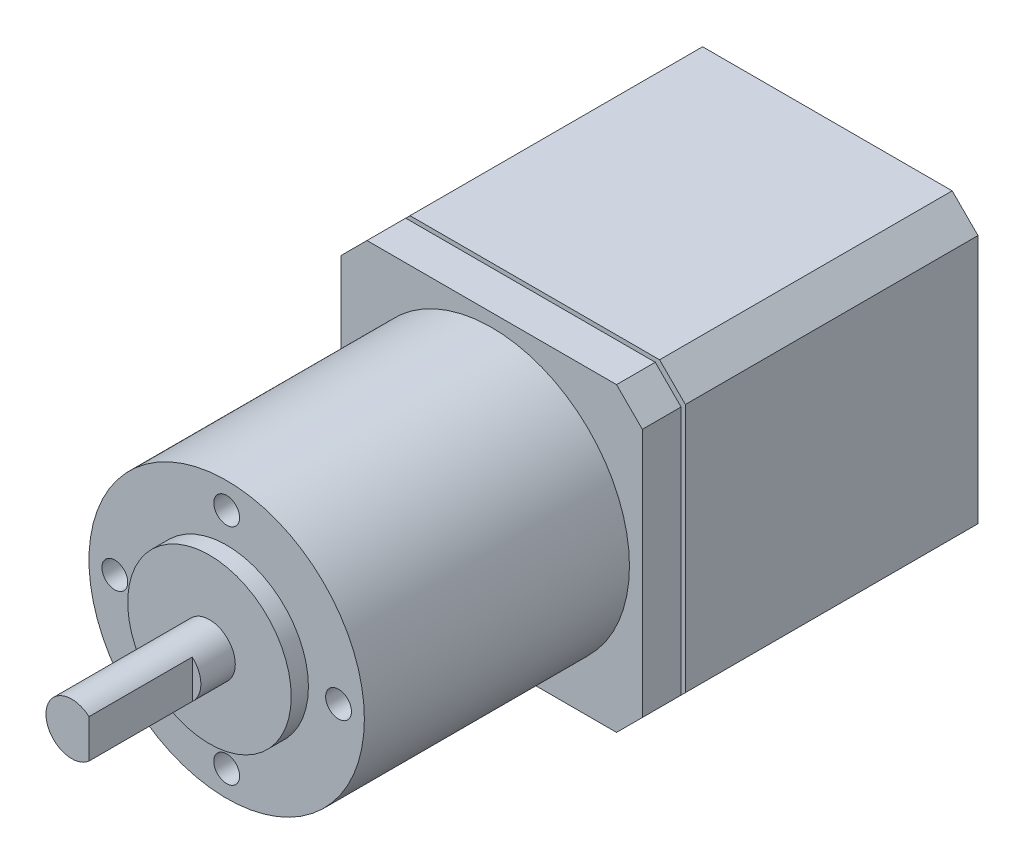
ISO-10303-21;
HEADER;
FILE_DESCRIPTION(('STEP AP214'),'2;1');
FILE_NAME('part.step','',(''),(''),'','','');
FILE_SCHEMA(('AUTOMOTIVE_DESIGN { 1 0 10303 214 1 1 1 1 }'));
ENDSEC;
DATA;
#1=APPLICATION_CONTEXT('core data for automotive mechanical design processes');
#2=APPLICATION_PROTOCOL_DEFINITION('international standard','automotive_design',2000,#1);
#3=PRODUCT_CONTEXT('',#1,'mechanical');
#4=PRODUCT('Part','Part','',(#3));
#5=PRODUCT_RELATED_PRODUCT_CATEGORY('part','',(#4));
#6=PRODUCT_DEFINITION_FORMATION('','',#4);
#7=PRODUCT_DEFINITION_CONTEXT('part definition',#1,'design');
#8=PRODUCT_DEFINITION('design','',#6,#7);
#9=PRODUCT_DEFINITION_SHAPE('','',#8);
#10=(LENGTH_UNIT() NAMED_UNIT(*) SI_UNIT(.MILLI.,.METRE.));
#11=(NAMED_UNIT(*) PLANE_ANGLE_UNIT() SI_UNIT($,.RADIAN.));
#12=(NAMED_UNIT(*) SI_UNIT($,.STERADIAN.) SOLID_ANGLE_UNIT());
#13=UNCERTAINTY_MEASURE_WITH_UNIT(LENGTH_MEASURE(1.E-05),#10,'distance_accuracy_value','');
#14=(GEOMETRIC_REPRESENTATION_CONTEXT(3) GLOBAL_UNCERTAINTY_ASSIGNED_CONTEXT((#13)) GLOBAL_UNIT_ASSIGNED_CONTEXT((#10,
#11,#12)) REPRESENTATION_CONTEXT('',''));
#15=CARTESIAN_POINT('',(0.,0.,0.));
#16=DIRECTION('',(0.,0.,1.));
#17=DIRECTION('',(1.,0.,0.));
#18=AXIS2_PLACEMENT_3D('',#15,#16,#17);
#19=CARTESIAN_POINT('',(0.,0.,69.8));
#20=DIRECTION('',(0.,0.,-1.));
#21=DIRECTION('',(-1.,0.,0.));
#22=AXIS2_PLACEMENT_3D('',#19,#20,#21);
#23=CYLINDRICAL_SURFACE('',#22,16.);
#24=CARTESIAN_POINT('',(0.,0.,39.));
#25=DIRECTION('',(0.,0.,1.));
#26=DIRECTION('',(1.,0.,0.));
#27=AXIS2_PLACEMENT_3D('',#24,#25,#26);
#28=CIRCLE('',#27,16.);
#29=CARTESIAN_POINT('',(16.,0.,39.));
#30=VERTEX_POINT('',#29);
#31=EDGE_CURVE('E39',#30,#30,#28,.T.);
#32=ORIENTED_EDGE('',*,*,#31,.T.);
#33=EDGE_LOOP('',(#32));
#34=FACE_BOUND('',#33,.T.);
#35=CARTESIAN_POINT('',(0.,0.,69.8));
#36=DIRECTION('',(0.,0.,1.));
#37=DIRECTION('',(1.,0.,0.));
#38=AXIS2_PLACEMENT_3D('',#35,#36,#37);
#39=CIRCLE('',#38,16.);
#40=CARTESIAN_POINT('',(16.,0.,69.8));
#41=VERTEX_POINT('',#40);
#42=EDGE_CURVE('E273',#41,#41,#39,.T.);
#43=ORIENTED_EDGE('',*,*,#42,.F.);
#44=EDGE_LOOP('',(#43));
#45=FACE_BOUND('',#44,.T.);
#46=ADVANCED_FACE('F35',(#34,#45),#23,.T.);
#47=CARTESIAN_POINT('',(0.,0.,69.8));
#48=DIRECTION('',(0.,0.,1.));
#49=DIRECTION('',(1.,0.,0.));
#50=AXIS2_PLACEMENT_3D('',#47,#48,#49);
#51=PLANE('',#50);
#52=CARTESIAN_POINT('',(13.,0.,69.8));
#53=DIRECTION('',(0.,0.,1.));
#54=DIRECTION('',(1.,0.,0.));
#55=AXIS2_PLACEMENT_3D('',#52,#53,#54);
#56=CIRCLE('',#55,1.5);
#57=CARTESIAN_POINT('',(14.5,0.,69.8));
#58=VERTEX_POINT('',#57);
#59=EDGE_CURVE('E244',#58,#58,#56,.T.);
#60=ORIENTED_EDGE('',*,*,#59,.F.);
#61=EDGE_LOOP('',(#60));
#62=FACE_BOUND('',#61,.T.);
#63=CARTESIAN_POINT('',(-13.,0.,69.8));
#64=DIRECTION('',(0.,0.,1.));
#65=DIRECTION('',(1.,0.,0.));
#66=AXIS2_PLACEMENT_3D('',#63,#64,#65);
#67=CIRCLE('',#66,1.5);
#68=CARTESIAN_POINT('',(-11.5,0.,69.8));
#69=VERTEX_POINT('',#68);
#70=EDGE_CURVE('E250',#69,#69,#67,.T.);
#71=ORIENTED_EDGE('',*,*,#70,.F.);
#72=EDGE_LOOP('',(#71));
#73=FACE_BOUND('',#72,.T.);
#74=CARTESIAN_POINT('',(0.,-13.,69.8));
#75=DIRECTION('',(0.,0.,1.));
#76=DIRECTION('',(1.,0.,0.));
#77=AXIS2_PLACEMENT_3D('',#74,#75,#76);
#78=CIRCLE('',#77,1.5);
#79=CARTESIAN_POINT('',(1.5,-13.,69.8));
#80=VERTEX_POINT('',#79);
#81=EDGE_CURVE('E256',#80,#80,#78,.T.);
#82=ORIENTED_EDGE('',*,*,#81,.F.);
#83=EDGE_LOOP('',(#82));
#84=FACE_BOUND('',#83,.T.);
#85=CARTESIAN_POINT('',(0.,13.,69.8));
#86=DIRECTION('',(0.,0.,1.));
#87=DIRECTION('',(1.,0.,0.));
#88=AXIS2_PLACEMENT_3D('',#85,#86,#87);
#89=CIRCLE('',#88,1.5);
#90=CARTESIAN_POINT('',(1.5,13.,69.8));
#91=VERTEX_POINT('',#90);
#92=EDGE_CURVE('E243',#91,#91,#89,.T.);
#93=ORIENTED_EDGE('',*,*,#92,.F.);
#94=EDGE_LOOP('',(#93));
#95=FACE_BOUND('',#94,.T.);
#96=CARTESIAN_POINT('',(0.,0.,69.8));
#97=DIRECTION('',(0.,0.,1.));
#98=DIRECTION('',(1.,0.,0.));
#99=AXIS2_PLACEMENT_3D('',#96,#97,#98);
#100=CIRCLE('',#99,9.5);
#101=CARTESIAN_POINT('',(9.5,0.,69.8));
#102=VERTEX_POINT('',#101);
#103=EDGE_CURVE('E270',#102,#102,#100,.T.);
#104=ORIENTED_EDGE('',*,*,#103,.F.);
#105=EDGE_LOOP('',(#104));
#106=FACE_BOUND('',#105,.T.);
#107=ORIENTED_EDGE('',*,*,#42,.T.);
#108=EDGE_LOOP('',(#107));
#109=FACE_BOUND('',#108,.T.);
#110=ADVANCED_FACE('F382',(#62,#73,#84,#95,#106,#109),#51,.T.);
#111=CARTESIAN_POINT('',(0.,0.,71.8));
#112=DIRECTION('',(0.,0.,-1.));
#113=DIRECTION('',(-1.,0.,0.));
#114=AXIS2_PLACEMENT_3D('',#111,#112,#113);
#115=CYLINDRICAL_SURFACE('',#114,9.5);
#116=CARTESIAN_POINT('',(0.,0.,71.8));
#117=DIRECTION('',(0.,0.,1.));
#118=DIRECTION('',(1.,0.,0.));
#119=AXIS2_PLACEMENT_3D('',#116,#117,#118);
#120=CIRCLE('',#119,9.5);
#121=CARTESIAN_POINT('',(9.5,0.,71.8));
#122=VERTEX_POINT('',#121);
#123=EDGE_CURVE('E266',#122,#122,#120,.T.);
#124=ORIENTED_EDGE('',*,*,#123,.F.);
#125=EDGE_LOOP('',(#124));
#126=FACE_BOUND('',#125,.T.);
#127=ORIENTED_EDGE('',*,*,#103,.T.);
#128=EDGE_LOOP('',(#127));
#129=FACE_BOUND('',#128,.T.);
#130=ADVANCED_FACE('F390',(#126,#129),#115,.T.);
#131=CARTESIAN_POINT('',(0.,0.,71.8));
#132=DIRECTION('',(0.,0.,1.));
#133=DIRECTION('',(1.,0.,0.));
#134=AXIS2_PLACEMENT_3D('',#131,#132,#133);
#135=PLANE('',#134);
#136=CARTESIAN_POINT('',(0.,0.,71.8));
#137=DIRECTION('',(0.,0.,1.));
#138=DIRECTION('',(1.,0.,0.));
#139=AXIS2_PLACEMENT_3D('',#136,#137,#138);
#140=CIRCLE('',#139,3.);
#141=CARTESIAN_POINT('',(3.,0.,71.8));
#142=VERTEX_POINT('',#141);
#143=EDGE_CURVE('E265',#142,#142,#140,.F.);
#144=ORIENTED_EDGE('',*,*,#143,.T.);
#145=EDGE_LOOP('',(#144));
#146=FACE_BOUND('',#145,.T.);
#147=ORIENTED_EDGE('',*,*,#123,.T.);
#148=EDGE_LOOP('',(#147));
#149=FACE_BOUND('',#148,.T.);
#150=ADVANCED_FACE('F515',(#146,#149),#135,.T.);
#151=CARTESIAN_POINT('',(0.,0.,87.8));
#152=DIRECTION('',(0.,0.,-1.));
#153=DIRECTION('',(-1.,0.,0.));
#154=AXIS2_PLACEMENT_3D('',#151,#152,#153);
#155=CYLINDRICAL_SURFACE('',#154,3.);
#156=CARTESIAN_POINT('',(0.,0.,87.8));
#157=DIRECTION('',(0.,0.,1.));
#158=DIRECTION('',(1.,0.,0.));
#159=AXIS2_PLACEMENT_3D('',#156,#157,#158);
#160=CIRCLE('',#159,3.);
#161=CARTESIAN_POINT('',(2.,2.23606797749979,87.8));
#162=VERTEX_POINT('',#161);
#163=CARTESIAN_POINT('',(2.,-2.23606797749979,87.8));
#164=VERTEX_POINT('',#163);
#165=EDGE_CURVE('E177',#162,#164,#160,.T.);
#166=ORIENTED_EDGE('',*,*,#165,.F.);
#167=DIRECTION('',(0.,0.,1.));
#168=VECTOR('',#167,1.);
#169=CARTESIAN_POINT('',(2.,2.23606797749979,75.8));
#170=LINE('',#169,#168);
#171=CARTESIAN_POINT('',(2.,2.23606797749979,75.8));
#172=VERTEX_POINT('',#171);
#173=EDGE_CURVE('E51',#172,#162,#170,.T.);
#174=ORIENTED_EDGE('',*,*,#173,.F.);
#175=CARTESIAN_POINT('',(0.,0.,75.8));
#176=DIRECTION('',(0.,0.,1.));
#177=DIRECTION('',(-1.,0.,0.));
#178=AXIS2_PLACEMENT_3D('',#175,#176,#177);
#179=CIRCLE('',#178,3.);
#180=CARTESIAN_POINT('',(2.,-2.23606797749979,75.8));
#181=VERTEX_POINT('',#180);
#182=EDGE_CURVE('E163',#181,#172,#179,.T.);
#183=ORIENTED_EDGE('',*,*,#182,.F.);
#184=DIRECTION('',(0.,0.,1.));
#185=VECTOR('',#184,1.);
#186=CARTESIAN_POINT('',(2.,-2.23606797749979,75.8));
#187=LINE('',#186,#185);
#188=EDGE_CURVE('E171',#181,#164,#187,.T.);
#189=ORIENTED_EDGE('',*,*,#188,.T.);
#190=EDGE_LOOP('',(#166,#174,#183,#189));
#191=FACE_BOUND('',#190,.T.);
#192=ORIENTED_EDGE('',*,*,#143,.F.);
#193=EDGE_LOOP('',(#192));
#194=FACE_BOUND('',#193,.T.);
#195=ADVANCED_FACE('F174',(#191,#194),#155,.T.);
#196=CARTESIAN_POINT('',(0.,0.,87.8));
#197=DIRECTION('',(0.,0.,1.));
#198=DIRECTION('',(1.,0.,0.));
#199=AXIS2_PLACEMENT_3D('',#196,#197,#198);
#200=PLANE('',#199);
#201=DIRECTION('',(0.,-1.,0.));
#202=VECTOR('',#201,1.);
#203=CARTESIAN_POINT('',(2.,2.23606797749979,87.8));
#204=LINE('',#203,#202);
#205=EDGE_CURVE('E168',#162,#164,#204,.T.);
#206=ORIENTED_EDGE('',*,*,#205,.F.);
#207=ORIENTED_EDGE('',*,*,#165,.T.);
#208=EDGE_LOOP('',(#206,#207));
#209=FACE_BOUND('',#208,.T.);
#210=ADVANCED_FACE('F509',(#209),#200,.T.);
#211=CARTESIAN_POINT('',(0.,13.,65.8));
#212=DIRECTION('',(0.,0.,1.));
#213=DIRECTION('',(1.,0.,0.));
#214=AXIS2_PLACEMENT_3D('',#211,#212,#213);
#215=CYLINDRICAL_SURFACE('',#214,1.5);
#216=CARTESIAN_POINT('',(0.,13.,65.8));
#217=DIRECTION('',(0.,0.,1.));
#218=DIRECTION('',(1.,0.,0.));
#219=AXIS2_PLACEMENT_3D('',#216,#217,#218);
#220=CIRCLE('',#219,1.5);
#221=CARTESIAN_POINT('',(1.5,13.,65.8));
#222=VERTEX_POINT('',#221);
#223=EDGE_CURVE('E259',#222,#222,#220,.T.);
#224=ORIENTED_EDGE('',*,*,#223,.F.);
#225=EDGE_LOOP('',(#224));
#226=FACE_BOUND('',#225,.T.);
#227=ORIENTED_EDGE('',*,*,#92,.T.);
#228=EDGE_LOOP('',(#227));
#229=FACE_BOUND('',#228,.T.);
#230=ADVANCED_FACE('F505',(#226,#229),#215,.F.);
#231=CARTESIAN_POINT('',(0.,13.,65.8));
#232=DIRECTION('',(0.,0.,1.));
#233=DIRECTION('',(1.,0.,0.));
#234=AXIS2_PLACEMENT_3D('',#231,#232,#233);
#235=PLANE('',#234);
#236=ORIENTED_EDGE('',*,*,#223,.T.);
#237=EDGE_LOOP('',(#236));
#238=FACE_BOUND('',#237,.T.);
#239=ADVANCED_FACE('F501',(#238),#235,.T.);
#240=CARTESIAN_POINT('',(0.,-13.,65.8));
#241=DIRECTION('',(0.,0.,1.));
#242=DIRECTION('',(1.,0.,0.));
#243=AXIS2_PLACEMENT_3D('',#240,#241,#242);
#244=CYLINDRICAL_SURFACE('',#243,1.5);
#245=CARTESIAN_POINT('',(0.,-13.,65.8));
#246=DIRECTION('',(0.,0.,1.));
#247=DIRECTION('',(1.,0.,0.));
#248=AXIS2_PLACEMENT_3D('',#245,#246,#247);
#249=CIRCLE('',#248,1.5);
#250=CARTESIAN_POINT('',(1.5,-13.,65.8));
#251=VERTEX_POINT('',#250);
#252=EDGE_CURVE('E253',#251,#251,#249,.T.);
#253=ORIENTED_EDGE('',*,*,#252,.F.);
#254=EDGE_LOOP('',(#253));
#255=FACE_BOUND('',#254,.T.);
#256=ORIENTED_EDGE('',*,*,#81,.T.);
#257=EDGE_LOOP('',(#256));
#258=FACE_BOUND('',#257,.T.);
#259=ADVANCED_FACE('F497',(#255,#258),#244,.F.);
#260=CARTESIAN_POINT('',(0.,-13.,65.8));
#261=DIRECTION('',(0.,0.,1.));
#262=DIRECTION('',(1.,0.,0.));
#263=AXIS2_PLACEMENT_3D('',#260,#261,#262);
#264=PLANE('',#263);
#265=ORIENTED_EDGE('',*,*,#252,.T.);
#266=EDGE_LOOP('',(#265));
#267=FACE_BOUND('',#266,.T.);
#268=ADVANCED_FACE('F493',(#267),#264,.T.);
#269=CARTESIAN_POINT('',(-13.,0.,65.8));
#270=DIRECTION('',(0.,0.,1.));
#271=DIRECTION('',(1.,0.,0.));
#272=AXIS2_PLACEMENT_3D('',#269,#270,#271);
#273=CYLINDRICAL_SURFACE('',#272,1.5);
#274=CARTESIAN_POINT('',(-13.,0.,65.8));
#275=DIRECTION('',(0.,0.,1.));
#276=DIRECTION('',(1.,0.,0.));
#277=AXIS2_PLACEMENT_3D('',#274,#275,#276);
#278=CIRCLE('',#277,1.5);
#279=CARTESIAN_POINT('',(-11.5,0.,65.8));
#280=VERTEX_POINT('',#279);
#281=EDGE_CURVE('E247',#280,#280,#278,.T.);
#282=ORIENTED_EDGE('',*,*,#281,.F.);
#283=EDGE_LOOP('',(#282));
#284=FACE_BOUND('',#283,.T.);
#285=ORIENTED_EDGE('',*,*,#70,.T.);
#286=EDGE_LOOP('',(#285));
#287=FACE_BOUND('',#286,.T.);
#288=ADVANCED_FACE('F489',(#284,#287),#273,.F.);
#289=CARTESIAN_POINT('',(-13.,0.,65.8));
#290=DIRECTION('',(0.,0.,1.));
#291=DIRECTION('',(1.,0.,0.));
#292=AXIS2_PLACEMENT_3D('',#289,#290,#291);
#293=PLANE('',#292);
#294=ORIENTED_EDGE('',*,*,#281,.T.);
#295=EDGE_LOOP('',(#294));
#296=FACE_BOUND('',#295,.T.);
#297=ADVANCED_FACE('F485',(#296),#293,.T.);
#298=CARTESIAN_POINT('',(13.,0.,65.8));
#299=DIRECTION('',(0.,0.,1.));
#300=DIRECTION('',(1.,0.,0.));
#301=AXIS2_PLACEMENT_3D('',#298,#299,#300);
#302=CYLINDRICAL_SURFACE('',#301,1.5);
#303=CARTESIAN_POINT('',(13.,0.,65.8));
#304=DIRECTION('',(0.,0.,1.));
#305=DIRECTION('',(1.,0.,0.));
#306=AXIS2_PLACEMENT_3D('',#303,#304,#305);
#307=CIRCLE('',#306,1.5);
#308=CARTESIAN_POINT('',(14.5,0.,65.8));
#309=VERTEX_POINT('',#308);
#310=EDGE_CURVE('E240',#309,#309,#307,.T.);
#311=ORIENTED_EDGE('',*,*,#310,.F.);
#312=EDGE_LOOP('',(#311));
#313=FACE_BOUND('',#312,.T.);
#314=ORIENTED_EDGE('',*,*,#59,.T.);
#315=EDGE_LOOP('',(#314));
#316=FACE_BOUND('',#315,.T.);
#317=ADVANCED_FACE('F481',(#313,#316),#302,.F.);
#318=CARTESIAN_POINT('',(13.,0.,65.8));
#319=DIRECTION('',(0.,0.,1.));
#320=DIRECTION('',(1.,0.,0.));
#321=AXIS2_PLACEMENT_3D('',#318,#319,#320);
#322=PLANE('',#321);
#323=ORIENTED_EDGE('',*,*,#310,.T.);
#324=EDGE_LOOP('',(#323));
#325=FACE_BOUND('',#324,.T.);
#326=ADVANCED_FACE('F478',(#325),#322,.T.);
#327=CARTESIAN_POINT('',(-14.5,17.5,39.));
#328=DIRECTION('',(0.707106781186546,-0.707106781186549,0.));
#329=DIRECTION('',(0.707106781186549,0.707106781186546,0.));
#330=AXIS2_PLACEMENT_3D('',#327,#328,#329);
#331=PLANE('',#330);
#332=DIRECTION('',(-0.707106781186549,-0.707106781186546,0.));
#333=VECTOR('',#332,1.);
#334=CARTESIAN_POINT('',(-14.5,17.5,34.5));
#335=LINE('',#334,#333);
#336=CARTESIAN_POINT('',(-14.5,17.5,34.5));
#337=VERTEX_POINT('',#336);
#338=CARTESIAN_POINT('',(-17.5,14.5,34.5));
#339=VERTEX_POINT('',#338);
#340=EDGE_CURVE('E179',#337,#339,#335,.T.);
#341=ORIENTED_EDGE('',*,*,#340,.T.);
#342=DIRECTION('',(0.,0.,-1.));
#343=VECTOR('',#342,1.);
#344=CARTESIAN_POINT('',(-17.5,14.5,39.));
#345=LINE('',#344,#343);
#346=CARTESIAN_POINT('',(-17.5,14.5,39.));
#347=VERTEX_POINT('',#346);
#348=EDGE_CURVE('E237',#347,#339,#345,.T.);
#349=ORIENTED_EDGE('',*,*,#348,.F.);
#350=DIRECTION('',(-0.707106781186549,-0.707106781186546,0.));
#351=VECTOR('',#350,1.);
#352=CARTESIAN_POINT('',(-14.5,17.5,39.));
#353=LINE('',#352,#351);
#354=CARTESIAN_POINT('',(-14.5,17.5,39.));
#355=VERTEX_POINT('',#354);
#356=EDGE_CURVE('E183',#355,#347,#353,.T.);
#357=ORIENTED_EDGE('',*,*,#356,.F.);
#358=DIRECTION('',(0.,0.,-1.));
#359=VECTOR('',#358,1.);
#360=CARTESIAN_POINT('',(-14.5,17.5,39.));
#361=LINE('',#360,#359);
#362=EDGE_CURVE('E201',#355,#337,#361,.T.);
#363=ORIENTED_EDGE('',*,*,#362,.T.);
#364=EDGE_LOOP('',(#341,#349,#357,#363));
#365=FACE_BOUND('',#364,.T.);
#366=ADVANCED_FACE('F421',(#365),#331,.F.);
#367=CARTESIAN_POINT('',(-17.5,14.5,39.));
#368=DIRECTION('',(1.,0.,0.));
#369=DIRECTION('',(0.,1.,0.));
#370=AXIS2_PLACEMENT_3D('',#367,#368,#369);
#371=PLANE('',#370);
#372=DIRECTION('',(0.,-1.,0.));
#373=VECTOR('',#372,1.);
#374=CARTESIAN_POINT('',(-17.5,14.5,34.5));
#375=LINE('',#374,#373);
#376=CARTESIAN_POINT('',(-17.5,-14.5,34.5));
#377=VERTEX_POINT('',#376);
#378=EDGE_CURVE('E204',#339,#377,#375,.T.);
#379=ORIENTED_EDGE('',*,*,#378,.T.);
#380=DIRECTION('',(0.,0.,-1.));
#381=VECTOR('',#380,1.);
#382=CARTESIAN_POINT('',(-17.5,-14.5,39.));
#383=LINE('',#382,#381);
#384=CARTESIAN_POINT('',(-17.5,-14.5,39.));
#385=VERTEX_POINT('',#384);
#386=EDGE_CURVE('E234',#385,#377,#383,.T.);
#387=ORIENTED_EDGE('',*,*,#386,.F.);
#388=DIRECTION('',(0.,-1.,0.));
#389=VECTOR('',#388,1.);
#390=CARTESIAN_POINT('',(-17.5,14.5,39.));
#391=LINE('',#390,#389);
#392=EDGE_CURVE('E186',#347,#385,#391,.T.);
#393=ORIENTED_EDGE('',*,*,#392,.F.);
#394=ORIENTED_EDGE('',*,*,#348,.T.);
#395=EDGE_LOOP('',(#379,#387,#393,#394));
#396=FACE_BOUND('',#395,.T.);
#397=ADVANCED_FACE('F452',(#396),#371,.F.);
#398=CARTESIAN_POINT('',(-17.5,-14.5,39.));
#399=DIRECTION('',(0.707106781186549,0.707106781186546,0.));
#400=DIRECTION('',(-0.707106781186546,0.707106781186549,0.));
#401=AXIS2_PLACEMENT_3D('',#398,#399,#400);
#402=PLANE('',#401);
#403=DIRECTION('',(0.707106781186546,-0.707106781186549,0.));
#404=VECTOR('',#403,1.);
#405=CARTESIAN_POINT('',(-17.5,-14.5,34.5));
#406=LINE('',#405,#404);
#407=CARTESIAN_POINT('',(-14.5,-17.5,34.5));
#408=VERTEX_POINT('',#407);
#409=EDGE_CURVE('E206',#377,#408,#406,.T.);
#410=ORIENTED_EDGE('',*,*,#409,.T.);
#411=DIRECTION('',(0.,0.,-1.));
#412=VECTOR('',#411,1.);
#413=CARTESIAN_POINT('',(-14.5,-17.5,39.));
#414=LINE('',#413,#412);
#415=CARTESIAN_POINT('',(-14.5,-17.5,39.));
#416=VERTEX_POINT('',#415);
#417=EDGE_CURVE('E231',#416,#408,#414,.T.);
#418=ORIENTED_EDGE('',*,*,#417,.F.);
#419=DIRECTION('',(0.707106781186546,-0.707106781186549,0.));
#420=VECTOR('',#419,1.);
#421=CARTESIAN_POINT('',(-17.5,-14.5,39.));
#422=LINE('',#421,#420);
#423=EDGE_CURVE('E189',#385,#416,#422,.T.);
#424=ORIENTED_EDGE('',*,*,#423,.F.);
#425=ORIENTED_EDGE('',*,*,#386,.T.);
#426=EDGE_LOOP('',(#410,#418,#424,#425));
#427=FACE_BOUND('',#426,.T.);
#428=ADVANCED_FACE('F448',(#427),#402,.F.);
#429=CARTESIAN_POINT('',(-14.5,-17.5,39.));
#430=DIRECTION('',(0.,1.,0.));
#431=DIRECTION('',(0.,0.,1.));
#432=AXIS2_PLACEMENT_3D('',#429,#430,#431);
#433=PLANE('',#432);
#434=DIRECTION('',(1.,0.,0.));
#435=VECTOR('',#434,1.);
#436=CARTESIAN_POINT('',(-14.5,-17.5,34.5));
#437=LINE('',#436,#435);
#438=CARTESIAN_POINT('',(14.5,-17.5,34.5));
#439=VERTEX_POINT('',#438);
#440=EDGE_CURVE('E208',#408,#439,#437,.T.);
#441=ORIENTED_EDGE('',*,*,#440,.T.);
#442=DIRECTION('',(0.,0.,-1.));
#443=VECTOR('',#442,1.);
#444=CARTESIAN_POINT('',(14.5,-17.5,39.));
#445=LINE('',#444,#443);
#446=CARTESIAN_POINT('',(14.5,-17.5,39.));
#447=VERTEX_POINT('',#446);
#448=EDGE_CURVE('E228',#447,#439,#445,.T.);
#449=ORIENTED_EDGE('',*,*,#448,.F.);
#450=DIRECTION('',(1.,0.,0.));
#451=VECTOR('',#450,1.);
#452=CARTESIAN_POINT('',(-14.5,-17.5,39.));
#453=LINE('',#452,#451);
#454=EDGE_CURVE('E191',#416,#447,#453,.T.);
#455=ORIENTED_EDGE('',*,*,#454,.F.);
#456=ORIENTED_EDGE('',*,*,#417,.T.);
#457=EDGE_LOOP('',(#441,#449,#455,#456));
#458=FACE_BOUND('',#457,.T.);
#459=ADVANCED_FACE('F445',(#458),#433,.F.);
#460=CARTESIAN_POINT('',(14.5,-17.5,39.));
#461=DIRECTION('',(-0.707106781186547,0.707106781186548,0.));
#462=DIRECTION('',(-0.707106781186548,-0.707106781186547,0.));
#463=AXIS2_PLACEMENT_3D('',#460,#461,#462);
#464=PLANE('',#463);
#465=DIRECTION('',(0.707106781186548,0.707106781186547,0.));
#466=VECTOR('',#465,1.);
#467=CARTESIAN_POINT('',(14.5,-17.5,34.5));
#468=LINE('',#467,#466);
#469=CARTESIAN_POINT('',(17.5,-14.5,34.5));
#470=VERTEX_POINT('',#469);
#471=EDGE_CURVE('E210',#439,#470,#468,.T.);
#472=ORIENTED_EDGE('',*,*,#471,.T.);
#473=DIRECTION('',(0.,0.,-1.));
#474=VECTOR('',#473,1.);
#475=CARTESIAN_POINT('',(17.5,-14.5,39.));
#476=LINE('',#475,#474);
#477=CARTESIAN_POINT('',(17.5,-14.5,39.));
#478=VERTEX_POINT('',#477);
#479=EDGE_CURVE('E225',#478,#470,#476,.T.);
#480=ORIENTED_EDGE('',*,*,#479,.F.);
#481=DIRECTION('',(0.707106781186548,0.707106781186547,0.));
#482=VECTOR('',#481,1.);
#483=CARTESIAN_POINT('',(14.5,-17.5,39.));
#484=LINE('',#483,#482);
#485=EDGE_CURVE('E193',#447,#478,#484,.T.);
#486=ORIENTED_EDGE('',*,*,#485,.F.);
#487=ORIENTED_EDGE('',*,*,#448,.T.);
#488=EDGE_LOOP('',(#472,#480,#486,#487));
#489=FACE_BOUND('',#488,.T.);
#490=ADVANCED_FACE('F441',(#489),#464,.F.);
#491=CARTESIAN_POINT('',(17.5,-14.5,39.));
#492=DIRECTION('',(-1.,0.,0.));
#493=DIRECTION('',(0.,-1.,0.));
#494=AXIS2_PLACEMENT_3D('',#491,#492,#493);
#495=PLANE('',#494);
#496=DIRECTION('',(0.,1.,0.));
#497=VECTOR('',#496,1.);
#498=CARTESIAN_POINT('',(17.5,-14.5,34.5));
#499=LINE('',#498,#497);
#500=CARTESIAN_POINT('',(17.5,14.5,34.5));
#501=VERTEX_POINT('',#500);
#502=EDGE_CURVE('E212',#470,#501,#499,.T.);
#503=ORIENTED_EDGE('',*,*,#502,.T.);
#504=DIRECTION('',(0.,0.,-1.));
#505=VECTOR('',#504,1.);
#506=CARTESIAN_POINT('',(17.5,14.5,39.));
#507=LINE('',#506,#505);
#508=CARTESIAN_POINT('',(17.5,14.5,39.));
#509=VERTEX_POINT('',#508);
#510=EDGE_CURVE('E222',#509,#501,#507,.T.);
#511=ORIENTED_EDGE('',*,*,#510,.F.);
#512=DIRECTION('',(0.,1.,0.));
#513=VECTOR('',#512,1.);
#514=CARTESIAN_POINT('',(17.5,-14.5,39.));
#515=LINE('',#514,#513);
#516=EDGE_CURVE('E195',#478,#509,#515,.T.);
#517=ORIENTED_EDGE('',*,*,#516,.F.);
#518=ORIENTED_EDGE('',*,*,#479,.T.);
#519=EDGE_LOOP('',(#503,#511,#517,#518));
#520=FACE_BOUND('',#519,.T.);
#521=ADVANCED_FACE('F436',(#520),#495,.F.);
#522=CARTESIAN_POINT('',(17.5,14.5,39.));
#523=DIRECTION('',(-0.707106781186549,-0.707106781186546,0.));
#524=DIRECTION('',(0.707106781186546,-0.707106781186549,0.));
#525=AXIS2_PLACEMENT_3D('',#522,#523,#524);
#526=PLANE('',#525);
#527=DIRECTION('',(-0.707106781186546,0.707106781186549,0.));
#528=VECTOR('',#527,1.);
#529=CARTESIAN_POINT('',(17.5,14.5,34.5));
#530=LINE('',#529,#528);
#531=CARTESIAN_POINT('',(14.5,17.5,34.5));
#532=VERTEX_POINT('',#531);
#533=EDGE_CURVE('E214',#501,#532,#530,.T.);
#534=ORIENTED_EDGE('',*,*,#533,.T.);
#535=DIRECTION('',(0.,0.,-1.));
#536=VECTOR('',#535,1.);
#537=CARTESIAN_POINT('',(14.5,17.5,39.));
#538=LINE('',#537,#536);
#539=CARTESIAN_POINT('',(14.5,17.5,39.));
#540=VERTEX_POINT('',#539);
#541=EDGE_CURVE('E219',#540,#532,#538,.T.);
#542=ORIENTED_EDGE('',*,*,#541,.F.);
#543=DIRECTION('',(-0.707106781186546,0.707106781186549,0.));
#544=VECTOR('',#543,1.);
#545=CARTESIAN_POINT('',(17.5,14.5,39.));
#546=LINE('',#545,#544);
#547=EDGE_CURVE('E197',#509,#540,#546,.T.);
#548=ORIENTED_EDGE('',*,*,#547,.F.);
#549=ORIENTED_EDGE('',*,*,#510,.T.);
#550=EDGE_LOOP('',(#534,#542,#548,#549));
#551=FACE_BOUND('',#550,.T.);
#552=ADVANCED_FACE('F430',(#551),#526,.F.);
#553=CARTESIAN_POINT('',(14.5,17.5,39.));
#554=DIRECTION('',(0.,-1.,0.));
#555=DIRECTION('',(0.,0.,-1.));
#556=AXIS2_PLACEMENT_3D('',#553,#554,#555);
#557=PLANE('',#556);
#558=DIRECTION('',(-1.,0.,0.));
#559=VECTOR('',#558,1.);
#560=CARTESIAN_POINT('',(14.5,17.5,34.5));
#561=LINE('',#560,#559);
#562=EDGE_CURVE('E187',#532,#337,#561,.T.);
#563=ORIENTED_EDGE('',*,*,#562,.T.);
#564=ORIENTED_EDGE('',*,*,#362,.F.);
#565=DIRECTION('',(-1.,0.,0.));
#566=VECTOR('',#565,1.);
#567=CARTESIAN_POINT('',(14.5,17.5,39.));
#568=LINE('',#567,#566);
#569=EDGE_CURVE('E199',#540,#355,#568,.T.);
#570=ORIENTED_EDGE('',*,*,#569,.F.);
#571=ORIENTED_EDGE('',*,*,#541,.T.);
#572=EDGE_LOOP('',(#563,#564,#570,#571));
#573=FACE_BOUND('',#572,.T.);
#574=ADVANCED_FACE('F426',(#573),#557,.F.);
#575=CARTESIAN_POINT('',(0.,0.,39.));
#576=DIRECTION('',(0.,0.,1.));
#577=DIRECTION('',(1.,0.,0.));
#578=AXIS2_PLACEMENT_3D('',#575,#576,#577);
#579=PLANE('',#578);
#580=ORIENTED_EDGE('',*,*,#31,.F.);
#581=EDGE_LOOP('',(#580));
#582=FACE_BOUND('',#581,.T.);
#583=ORIENTED_EDGE('',*,*,#356,.T.);
#584=ORIENTED_EDGE('',*,*,#392,.T.);
#585=ORIENTED_EDGE('',*,*,#423,.T.);
#586=ORIENTED_EDGE('',*,*,#454,.T.);
#587=ORIENTED_EDGE('',*,*,#485,.T.);
#588=ORIENTED_EDGE('',*,*,#516,.T.);
#589=ORIENTED_EDGE('',*,*,#547,.T.);
#590=ORIENTED_EDGE('',*,*,#569,.T.);
#591=EDGE_LOOP('',(#583,#584,#585,#586,#587,#588,#589,#590));
#592=FACE_BOUND('',#591,.T.);
#593=ADVANCED_FACE('F413',(#582,#592),#579,.T.);
#594=CARTESIAN_POINT('',(0.,0.,34.5));
#595=DIRECTION('',(0.,0.,1.));
#596=DIRECTION('',(1.,0.,0.));
#597=AXIS2_PLACEMENT_3D('',#594,#595,#596);
#598=PLANE('',#597);
#599=CARTESIAN_POINT('',(0.,0.,34.5));
#600=DIRECTION('',(0.,0.,1.));
#601=DIRECTION('',(1.,0.,0.));
#602=AXIS2_PLACEMENT_3D('',#599,#600,#601);
#603=CIRCLE('',#602,16.);
#604=CARTESIAN_POINT('',(16.,0.,34.5));
#605=VERTEX_POINT('',#604);
#606=EDGE_CURVE('E11',#605,#605,#603,.T.);
#607=ORIENTED_EDGE('',*,*,#606,.T.);
#608=EDGE_LOOP('',(#607));
#609=FACE_BOUND('',#608,.T.);
#610=ORIENTED_EDGE('',*,*,#340,.F.);
#611=ORIENTED_EDGE('',*,*,#562,.F.);
#612=ORIENTED_EDGE('',*,*,#533,.F.);
#613=ORIENTED_EDGE('',*,*,#502,.F.);
#614=ORIENTED_EDGE('',*,*,#471,.F.);
#615=ORIENTED_EDGE('',*,*,#440,.F.);
#616=ORIENTED_EDGE('',*,*,#409,.F.);
#617=ORIENTED_EDGE('',*,*,#378,.F.);
#618=EDGE_LOOP('',(#610,#611,#612,#613,#614,#615,#616,#617));
#619=FACE_BOUND('',#618,.T.);
#620=ADVANCED_FACE('F410',(#609,#619),#598,.F.);
#621=CARTESIAN_POINT('',(0.,0.,0.));
#622=DIRECTION('',(0.,0.,1.));
#623=DIRECTION('',(1.,0.,0.));
#624=AXIS2_PLACEMENT_3D('',#621,#622,#623);
#625=PLANE('',#624);
#626=DIRECTION('',(1.,0.,0.));
#627=VECTOR('',#626,1.);
#628=CARTESIAN_POINT('',(-17.5,-17.5,0.));
#629=LINE('',#628,#627);
#630=CARTESIAN_POINT('',(-14.5,-17.5,0.));
#631=VERTEX_POINT('',#630);
#632=CARTESIAN_POINT('',(14.5,-17.5,0.));
#633=VERTEX_POINT('',#632);
#634=EDGE_CURVE('E294',#631,#633,#629,.T.);
#635=ORIENTED_EDGE('',*,*,#634,.F.);
#636=DIRECTION('',(0.707106781186546,-0.707106781186549,0.));
#637=VECTOR('',#636,1.);
#638=CARTESIAN_POINT('',(-14.5,-17.5,0.));
#639=LINE('',#638,#637);
#640=CARTESIAN_POINT('',(-17.5,-14.5,0.));
#641=VERTEX_POINT('',#640);
#642=EDGE_CURVE('E313',#631,#641,#639,.F.);
#643=ORIENTED_EDGE('',*,*,#642,.T.);
#644=DIRECTION('',(0.,-1.,0.));
#645=VECTOR('',#644,1.);
#646=CARTESIAN_POINT('',(-17.5,17.5,0.));
#647=LINE('',#646,#645);
#648=CARTESIAN_POINT('',(-17.5,14.5,0.));
#649=VERTEX_POINT('',#648);
#650=EDGE_CURVE('E276',#649,#641,#647,.T.);
#651=ORIENTED_EDGE('',*,*,#650,.F.);
#652=DIRECTION('',(-0.707106781186549,-0.707106781186546,0.));
#653=VECTOR('',#652,1.);
#654=CARTESIAN_POINT('',(-17.5,14.5,0.));
#655=LINE('',#654,#653);
#656=CARTESIAN_POINT('',(-14.5,17.5,0.));
#657=VERTEX_POINT('',#656);
#658=EDGE_CURVE('E309',#649,#657,#655,.F.);
#659=ORIENTED_EDGE('',*,*,#658,.T.);
#660=DIRECTION('',(-1.,0.,0.));
#661=VECTOR('',#660,1.);
#662=CARTESIAN_POINT('',(-17.5,17.5,0.));
#663=LINE('',#662,#661);
#664=CARTESIAN_POINT('',(14.5,17.5,0.));
#665=VERTEX_POINT('',#664);
#666=EDGE_CURVE('E283',#665,#657,#663,.T.);
#667=ORIENTED_EDGE('',*,*,#666,.F.);
#668=DIRECTION('',(-0.707106781186546,0.707106781186549,0.));
#669=VECTOR('',#668,1.);
#670=CARTESIAN_POINT('',(14.5,17.5,0.));
#671=LINE('',#670,#669);
#672=CARTESIAN_POINT('',(17.5,14.5,0.));
#673=VERTEX_POINT('',#672);
#674=EDGE_CURVE('E307',#665,#673,#671,.F.);
#675=ORIENTED_EDGE('',*,*,#674,.T.);
#676=DIRECTION('',(0.,1.,0.));
#677=VECTOR('',#676,1.);
#678=CARTESIAN_POINT('',(17.5,17.5,0.));
#679=LINE('',#678,#677);
#680=CARTESIAN_POINT('',(17.5,-14.5,0.));
#681=VERTEX_POINT('',#680);
#682=EDGE_CURVE('E297',#681,#673,#679,.T.);
#683=ORIENTED_EDGE('',*,*,#682,.F.);
#684=DIRECTION('',(0.707106781186548,0.707106781186547,0.));
#685=VECTOR('',#684,1.);
#686=CARTESIAN_POINT('',(17.5,-14.5,0.));
#687=LINE('',#686,#685);
#688=EDGE_CURVE('E311',#681,#633,#687,.F.);
#689=ORIENTED_EDGE('',*,*,#688,.T.);
#690=EDGE_LOOP('',(#635,#643,#651,#659,#667,#675,#683,#689));
#691=FACE_BOUND('',#690,.T.);
#692=ADVANCED_FACE('F343',(#691),#625,.F.);
#693=CARTESIAN_POINT('',(-17.5,14.5,34.));
#694=DIRECTION('',(0.707106781186546,-0.707106781186549,0.));
#695=DIRECTION('',(0.,0.,-1.));
#696=AXIS2_PLACEMENT_3D('',#693,#694,#695);
#697=PLANE('',#696);
#698=DIRECTION('',(0.707106781186549,0.707106781186546,0.));
#699=VECTOR('',#698,1.);
#700=CARTESIAN_POINT('',(-16.,16.,34.));
#701=LINE('',#700,#699);
#702=CARTESIAN_POINT('',(-14.5,17.5,34.));
#703=VERTEX_POINT('',#702);
#704=CARTESIAN_POINT('',(-17.5,14.5,34.));
#705=VERTEX_POINT('',#704);
#706=EDGE_CURVE('E322',#703,#705,#701,.F.);
#707=ORIENTED_EDGE('',*,*,#706,.F.);
#708=DIRECTION('',(0.,0.,1.));
#709=VECTOR('',#708,1.);
#710=CARTESIAN_POINT('',(-14.5,17.5,34.));
#711=LINE('',#710,#709);
#712=EDGE_CURVE('E44',#657,#703,#711,.T.);
#713=ORIENTED_EDGE('',*,*,#712,.F.);
#714=ORIENTED_EDGE('',*,*,#658,.F.);
#715=DIRECTION('',(0.,0.,-1.));
#716=VECTOR('',#715,1.);
#717=CARTESIAN_POINT('',(-17.5,14.5,34.));
#718=LINE('',#717,#716);
#719=EDGE_CURVE('E315',#705,#649,#718,.T.);
#720=ORIENTED_EDGE('',*,*,#719,.F.);
#721=EDGE_LOOP('',(#707,#713,#714,#720));
#722=FACE_BOUND('',#721,.T.);
#723=ADVANCED_FACE('F349',(#722),#697,.F.);
#724=CARTESIAN_POINT('',(-17.5,17.5,34.));
#725=DIRECTION('',(0.,-1.,0.));
#726=DIRECTION('',(0.,0.,-1.));
#727=AXIS2_PLACEMENT_3D('',#724,#725,#726);
#728=PLANE('',#727);
#729=ORIENTED_EDGE('',*,*,#666,.T.);
#730=ORIENTED_EDGE('',*,*,#712,.T.);
#731=DIRECTION('',(-1.,0.,0.));
#732=VECTOR('',#731,1.);
#733=CARTESIAN_POINT('',(-17.5,17.5,34.));
#734=LINE('',#733,#732);
#735=CARTESIAN_POINT('',(14.5,17.5,34.));
#736=VERTEX_POINT('',#735);
#737=EDGE_CURVE('E289',#736,#703,#734,.T.);
#738=ORIENTED_EDGE('',*,*,#737,.F.);
#739=DIRECTION('',(0.,0.,-1.));
#740=VECTOR('',#739,1.);
#741=CARTESIAN_POINT('',(14.5,17.5,34.));
#742=LINE('',#741,#740);
#743=EDGE_CURVE('E333',#736,#665,#742,.T.);
#744=ORIENTED_EDGE('',*,*,#743,.T.);
#745=EDGE_LOOP('',(#729,#730,#738,#744));
#746=FACE_BOUND('',#745,.T.);
#747=ADVANCED_FACE('F338',(#746),#728,.F.);
#748=CARTESIAN_POINT('',(14.5,17.5,34.));
#749=DIRECTION('',(-0.707106781186549,-0.707106781186546,0.));
#750=DIRECTION('',(0.,0.,-1.));
#751=AXIS2_PLACEMENT_3D('',#748,#749,#750);
#752=PLANE('',#751);
#753=DIRECTION('',(0.707106781186546,-0.707106781186549,0.));
#754=VECTOR('',#753,1.);
#755=CARTESIAN_POINT('',(16.,16.,34.));
#756=LINE('',#755,#754);
#757=CARTESIAN_POINT('',(17.5,14.5,34.));
#758=VERTEX_POINT('',#757);
#759=EDGE_CURVE('E320',#758,#736,#756,.F.);
#760=ORIENTED_EDGE('',*,*,#759,.F.);
#761=DIRECTION('',(0.,0.,1.));
#762=VECTOR('',#761,1.);
#763=CARTESIAN_POINT('',(17.5,14.5,34.));
#764=LINE('',#763,#762);
#765=EDGE_CURVE('E328',#673,#758,#764,.T.);
#766=ORIENTED_EDGE('',*,*,#765,.F.);
#767=ORIENTED_EDGE('',*,*,#674,.F.);
#768=ORIENTED_EDGE('',*,*,#743,.F.);
#769=EDGE_LOOP('',(#760,#766,#767,#768));
#770=FACE_BOUND('',#769,.T.);
#771=ADVANCED_FACE('F37',(#770),#752,.F.);
#772=CARTESIAN_POINT('',(17.5,17.5,34.));
#773=DIRECTION('',(-1.,0.,0.));
#774=DIRECTION('',(0.,-1.,0.));
#775=AXIS2_PLACEMENT_3D('',#772,#773,#774);
#776=PLANE('',#775);
#777=DIRECTION('',(0.,1.,0.));
#778=VECTOR('',#777,1.);
#779=CARTESIAN_POINT('',(17.5,17.5,34.));
#780=LINE('',#779,#778);
#781=CARTESIAN_POINT('',(17.5,-14.5,34.));
#782=VERTEX_POINT('',#781);
#783=EDGE_CURVE('E286',#782,#758,#780,.T.);
#784=ORIENTED_EDGE('',*,*,#783,.F.);
#785=DIRECTION('',(0.,0.,-1.));
#786=VECTOR('',#785,1.);
#787=CARTESIAN_POINT('',(17.5,-14.5,34.));
#788=LINE('',#787,#786);
#789=EDGE_CURVE('E330',#782,#681,#788,.T.);
#790=ORIENTED_EDGE('',*,*,#789,.T.);
#791=ORIENTED_EDGE('',*,*,#682,.T.);
#792=ORIENTED_EDGE('',*,*,#765,.T.);
#793=EDGE_LOOP('',(#784,#790,#791,#792));
#794=FACE_BOUND('',#793,.T.);
#795=ADVANCED_FACE('F370',(#794),#776,.F.);
#796=CARTESIAN_POINT('',(17.5,-14.5,34.));
#797=DIRECTION('',(-0.707106781186547,0.707106781186548,0.));
#798=DIRECTION('',(0.,0.,-1.));
#799=AXIS2_PLACEMENT_3D('',#796,#797,#798);
#800=PLANE('',#799);
#801=DIRECTION('',(-0.707106781186548,-0.707106781186547,0.));
#802=VECTOR('',#801,1.);
#803=CARTESIAN_POINT('',(16.,-16.,34.));
#804=LINE('',#803,#802);
#805=CARTESIAN_POINT('',(14.5,-17.5,34.));
#806=VERTEX_POINT('',#805);
#807=EDGE_CURVE('E324',#806,#782,#804,.F.);
#808=ORIENTED_EDGE('',*,*,#807,.F.);
#809=DIRECTION('',(0.,0.,1.));
#810=VECTOR('',#809,1.);
#811=CARTESIAN_POINT('',(14.5,-17.5,34.));
#812=LINE('',#811,#810);
#813=EDGE_CURVE('E291',#633,#806,#812,.T.);
#814=ORIENTED_EDGE('',*,*,#813,.F.);
#815=ORIENTED_EDGE('',*,*,#688,.F.);
#816=ORIENTED_EDGE('',*,*,#789,.F.);
#817=EDGE_LOOP('',(#808,#814,#815,#816));
#818=FACE_BOUND('',#817,.T.);
#819=ADVANCED_FACE('F367',(#818),#800,.F.);
#820=CARTESIAN_POINT('',(-17.5,-17.5,34.));
#821=DIRECTION('',(0.,1.,0.));
#822=DIRECTION('',(0.,0.,1.));
#823=AXIS2_PLACEMENT_3D('',#820,#821,#822);
#824=PLANE('',#823);
#825=DIRECTION('',(1.,0.,0.));
#826=VECTOR('',#825,1.);
#827=CARTESIAN_POINT('',(-17.5,-17.5,34.));
#828=LINE('',#827,#826);
#829=CARTESIAN_POINT('',(-14.5,-17.5,34.));
#830=VERTEX_POINT('',#829);
#831=EDGE_CURVE('E282',#830,#806,#828,.T.);
#832=ORIENTED_EDGE('',*,*,#831,.F.);
#833=DIRECTION('',(0.,0.,-1.));
#834=VECTOR('',#833,1.);
#835=CARTESIAN_POINT('',(-14.5,-17.5,34.));
#836=LINE('',#835,#834);
#837=EDGE_CURVE('E304',#830,#631,#836,.T.);
#838=ORIENTED_EDGE('',*,*,#837,.T.);
#839=ORIENTED_EDGE('',*,*,#634,.T.);
#840=ORIENTED_EDGE('',*,*,#813,.T.);
#841=EDGE_LOOP('',(#832,#838,#839,#840));
#842=FACE_BOUND('',#841,.T.);
#843=ADVANCED_FACE('F362',(#842),#824,.F.);
#844=CARTESIAN_POINT('',(-14.5,-17.5,34.));
#845=DIRECTION('',(0.707106781186549,0.707106781186546,0.));
#846=DIRECTION('',(0.,0.,-1.));
#847=AXIS2_PLACEMENT_3D('',#844,#845,#846);
#848=PLANE('',#847);
#849=DIRECTION('',(-0.707106781186546,0.707106781186549,0.));
#850=VECTOR('',#849,1.);
#851=CARTESIAN_POINT('',(-16.,-16.,34.));
#852=LINE('',#851,#850);
#853=CARTESIAN_POINT('',(-17.5,-14.5,34.));
#854=VERTEX_POINT('',#853);
#855=EDGE_CURVE('E326',#854,#830,#852,.F.);
#856=ORIENTED_EDGE('',*,*,#855,.F.);
#857=DIRECTION('',(0.,0.,1.));
#858=VECTOR('',#857,1.);
#859=CARTESIAN_POINT('',(-17.5,-14.5,34.));
#860=LINE('',#859,#858);
#861=EDGE_CURVE('E318',#641,#854,#860,.T.);
#862=ORIENTED_EDGE('',*,*,#861,.F.);
#863=ORIENTED_EDGE('',*,*,#642,.F.);
#864=ORIENTED_EDGE('',*,*,#837,.F.);
#865=EDGE_LOOP('',(#856,#862,#863,#864));
#866=FACE_BOUND('',#865,.T.);
#867=ADVANCED_FACE('F360',(#866),#848,.F.);
#868=CARTESIAN_POINT('',(-17.5,17.5,34.));
#869=DIRECTION('',(1.,0.,0.));
#870=DIRECTION('',(0.,1.,0.));
#871=AXIS2_PLACEMENT_3D('',#868,#869,#870);
#872=PLANE('',#871);
#873=ORIENTED_EDGE('',*,*,#650,.T.);
#874=ORIENTED_EDGE('',*,*,#861,.T.);
#875=DIRECTION('',(0.,-1.,0.));
#876=VECTOR('',#875,1.);
#877=CARTESIAN_POINT('',(-17.5,17.5,34.));
#878=LINE('',#877,#876);
#879=EDGE_CURVE('E279',#705,#854,#878,.T.);
#880=ORIENTED_EDGE('',*,*,#879,.F.);
#881=ORIENTED_EDGE('',*,*,#719,.T.);
#882=EDGE_LOOP('',(#873,#874,#880,#881));
#883=FACE_BOUND('',#882,.T.);
#884=ADVANCED_FACE('F352',(#883),#872,.F.);
#885=CARTESIAN_POINT('',(0.,0.,34.));
#886=DIRECTION('',(0.,0.,1.));
#887=DIRECTION('',(1.,0.,0.));
#888=AXIS2_PLACEMENT_3D('',#885,#886,#887);
#889=PLANE('',#888);
#890=CARTESIAN_POINT('',(0.,0.,34.));
#891=DIRECTION('',(0.,0.,1.));
#892=DIRECTION('',(1.,0.,0.));
#893=AXIS2_PLACEMENT_3D('',#890,#891,#892);
#894=CIRCLE('',#893,16.);
#895=CARTESIAN_POINT('',(16.,0.,34.));
#896=VERTEX_POINT('',#895);
#897=EDGE_CURVE('E269',#896,#896,#894,.T.);
#898=ORIENTED_EDGE('',*,*,#897,.F.);
#899=EDGE_LOOP('',(#898));
#900=FACE_BOUND('',#899,.T.);
#901=ORIENTED_EDGE('',*,*,#879,.T.);
#902=ORIENTED_EDGE('',*,*,#855,.T.);
#903=ORIENTED_EDGE('',*,*,#831,.T.);
#904=ORIENTED_EDGE('',*,*,#807,.T.);
#905=ORIENTED_EDGE('',*,*,#783,.T.);
#906=ORIENTED_EDGE('',*,*,#759,.T.);
#907=ORIENTED_EDGE('',*,*,#737,.T.);
#908=ORIENTED_EDGE('',*,*,#706,.T.);
#909=EDGE_LOOP('',(#901,#902,#903,#904,#905,#906,#907,#908));
#910=FACE_BOUND('',#909,.T.);
#911=ADVANCED_FACE('F356',(#900,#910),#889,.T.);
#912=ORIENTED_EDGE('',*,*,#897,.T.);
#913=EDGE_LOOP('',(#912));
#914=FACE_BOUND('',#913,.T.);
#915=ORIENTED_EDGE('',*,*,#606,.F.);
#916=EDGE_LOOP('',(#915));
#917=FACE_BOUND('',#916,.T.);
#918=ADVANCED_FACE('F385',(#914,#917),#23,.T.);
#919=CARTESIAN_POINT('',(2.,2.23606797749979,75.8));
#920=DIRECTION('',(-1.,0.,0.));
#921=DIRECTION('',(0.,-1.,0.));
#922=AXIS2_PLACEMENT_3D('',#919,#920,#921);
#923=PLANE('',#922);
#924=ORIENTED_EDGE('',*,*,#205,.T.);
#925=ORIENTED_EDGE('',*,*,#188,.F.);
#926=DIRECTION('',(0.,-1.,0.));
#927=VECTOR('',#926,1.);
#928=CARTESIAN_POINT('',(2.,2.23606797749979,75.8));
#929=LINE('',#928,#927);
#930=EDGE_CURVE('E165',#172,#181,#929,.T.);
#931=ORIENTED_EDGE('',*,*,#930,.F.);
#932=ORIENTED_EDGE('',*,*,#173,.T.);
#933=EDGE_LOOP('',(#924,#925,#931,#932));
#934=FACE_BOUND('',#933,.T.);
#935=ADVANCED_FACE('F170',(#934),#923,.F.);
#936=CARTESIAN_POINT('',(0.,0.,75.8));
#937=DIRECTION('',(0.,0.,-1.));
#938=DIRECTION('',(-1.,0.,0.));
#939=AXIS2_PLACEMENT_3D('',#936,#937,#938);
#940=PLANE('',#939);
#941=ORIENTED_EDGE('',*,*,#182,.T.);
#942=ORIENTED_EDGE('',*,*,#930,.T.);
#943=EDGE_LOOP('',(#941,#942));
#944=FACE_BOUND('',#943,.T.);
#945=ADVANCED_FACE('F164',(#944),#940,.F.);
#946=CLOSED_SHELL('',(#46,#110,#130,#150,#195,#210,#230,#239,#259,#268,#288,#297,#317,#326,#366,
#397,#428,#459,#490,#521,#552,#574,#593,#620,#692,#723,#747,#771,#795,#819,#843,#867,#884,#911,
#918,#935,#945));
#947=MANIFOLD_SOLID_BREP('B2',#946);
#948=ADVANCED_BREP_SHAPE_REPRESENTATION('',(#18,#947),#14);
#949=SHAPE_DEFINITION_REPRESENTATION(#9,#948);
ENDSEC;
END-ISO-10303-21;
